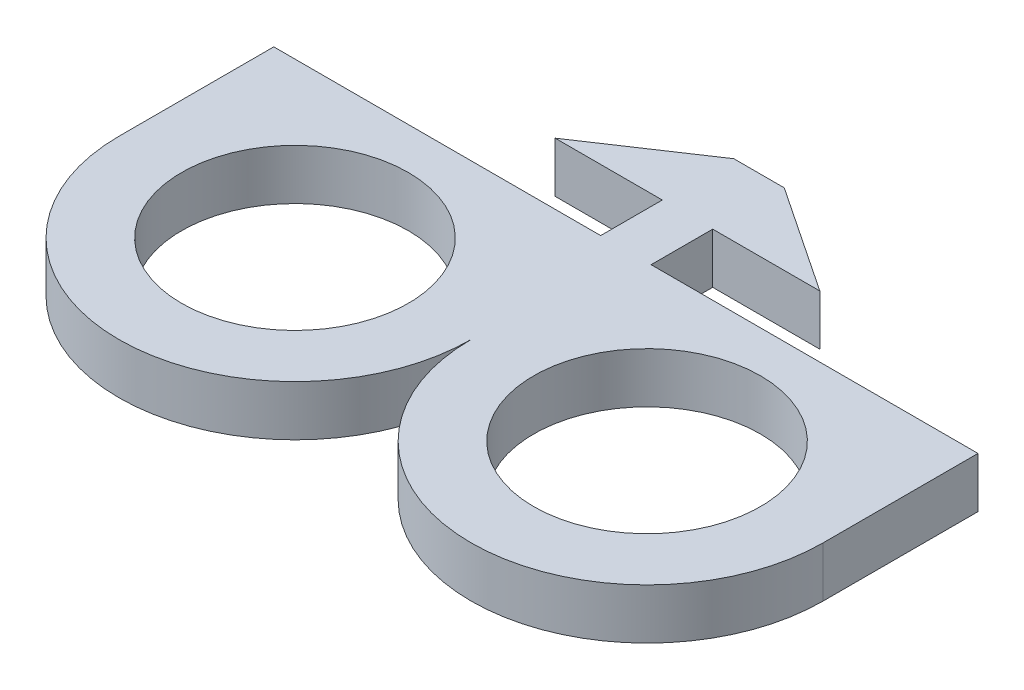
ISO-10303-21;
HEADER;
FILE_DESCRIPTION(('STEP AP214'),'2;1');
FILE_NAME('part.step','',(''),(''),'','','');
FILE_SCHEMA(('AUTOMOTIVE_DESIGN { 1 0 10303 214 1 1 1 1 }'));
ENDSEC;
DATA;
#1=APPLICATION_CONTEXT('core data for automotive mechanical design processes');
#2=APPLICATION_PROTOCOL_DEFINITION('international standard','automotive_design',2000,#1);
#3=PRODUCT_CONTEXT('',#1,'mechanical');
#4=PRODUCT('Part','Part','',(#3));
#5=PRODUCT_RELATED_PRODUCT_CATEGORY('part','',(#4));
#6=PRODUCT_DEFINITION_FORMATION('','',#4);
#7=PRODUCT_DEFINITION_CONTEXT('part definition',#1,'design');
#8=PRODUCT_DEFINITION('design','',#6,#7);
#9=PRODUCT_DEFINITION_SHAPE('','',#8);
#10=(LENGTH_UNIT() NAMED_UNIT(*) SI_UNIT(.MILLI.,.METRE.));
#11=(NAMED_UNIT(*) PLANE_ANGLE_UNIT() SI_UNIT($,.RADIAN.));
#12=(NAMED_UNIT(*) SI_UNIT($,.STERADIAN.) SOLID_ANGLE_UNIT());
#13=UNCERTAINTY_MEASURE_WITH_UNIT(LENGTH_MEASURE(1.E-05),#10,'distance_accuracy_value','');
#14=(GEOMETRIC_REPRESENTATION_CONTEXT(3) GLOBAL_UNCERTAINTY_ASSIGNED_CONTEXT((#13)) GLOBAL_UNIT_ASSIGNED_CONTEXT((#10,
#11,#12)) REPRESENTATION_CONTEXT('',''));
#15=CARTESIAN_POINT('',(0.,0.,0.));
#16=DIRECTION('',(0.,0.,1.));
#17=DIRECTION('',(1.,0.,0.));
#18=AXIS2_PLACEMENT_3D('',#15,#16,#17);
#19=CARTESIAN_POINT('',(25.0063,3.5814,0.));
#20=DIRECTION('',(-1.,0.,0.));
#21=DIRECTION('',(0.,0.,1.));
#22=AXIS2_PLACEMENT_3D('',#19,#20,#21);
#23=PLANE('',#22);
#24=DIRECTION('',(0.,0.,-1.));
#25=VECTOR('',#24,1.);
#26=CARTESIAN_POINT('',(25.0063,0.,0.));
#27=LINE('',#26,#25);
#28=CARTESIAN_POINT('',(25.0063,0.,13.1856988));
#29=VERTEX_POINT('',#28);
#30=CARTESIAN_POINT('',(25.0063,0.,2.1874988));
#31=VERTEX_POINT('',#30);
#32=EDGE_CURVE('E176',#29,#31,#27,.T.);
#33=ORIENTED_EDGE('',*,*,#32,.T.);
#34=DIRECTION('',(0.,-1.,0.));
#35=VECTOR('',#34,1.);
#36=CARTESIAN_POINT('',(25.0063,3.5814,2.1874988));
#37=LINE('',#36,#35);
#38=CARTESIAN_POINT('',(25.0063,3.5814,2.1874988));
#39=VERTEX_POINT('',#38);
#40=EDGE_CURVE('E54',#39,#31,#37,.T.);
#41=ORIENTED_EDGE('',*,*,#40,.F.);
#42=DIRECTION('',(0.,0.,-1.));
#43=VECTOR('',#42,1.);
#44=CARTESIAN_POINT('',(25.0063,3.5814,0.));
#45=LINE('',#44,#43);
#46=CARTESIAN_POINT('',(25.0063,3.5814,13.1856988));
#47=VERTEX_POINT('',#46);
#48=EDGE_CURVE('E119',#47,#39,#45,.T.);
#49=ORIENTED_EDGE('',*,*,#48,.F.);
#50=DIRECTION('',(0.,-1.,0.));
#51=VECTOR('',#50,1.);
#52=CARTESIAN_POINT('',(25.0063,3.5814,13.1856988));
#53=LINE('',#52,#51);
#54=EDGE_CURVE('E12',#47,#29,#53,.T.);
#55=ORIENTED_EDGE('',*,*,#54,.T.);
#56=EDGE_LOOP('',(#33,#41,#49,#55));
#57=FACE_BOUND('',#56,.T.);
#58=ADVANCED_FACE('F47',(#57),#23,.F.);
#59=CARTESIAN_POINT('',(0.,3.5814,2.1874988));
#60=DIRECTION('',(0.,0.,-1.));
#61=DIRECTION('',(-1.,0.,0.));
#62=AXIS2_PLACEMENT_3D('',#59,#60,#61);
#63=PLANE('',#62);
#64=DIRECTION('',(1.,0.,0.));
#65=VECTOR('',#64,1.);
#66=CARTESIAN_POINT('',(0.,0.,2.1874988));
#67=LINE('',#66,#65);
#68=CARTESIAN_POINT('',(1.7907,0.,2.1874988));
#69=VERTEX_POINT('',#68);
#70=EDGE_CURVE('E179',#69,#31,#67,.T.);
#71=ORIENTED_EDGE('',*,*,#70,.F.);
#72=DIRECTION('',(0.,-1.,0.));
#73=VECTOR('',#72,1.);
#74=CARTESIAN_POINT('',(1.7907,3.5814,2.1874988));
#75=LINE('',#74,#73);
#76=CARTESIAN_POINT('',(1.7907,3.5814,2.1874988));
#77=VERTEX_POINT('',#76);
#78=EDGE_CURVE('E219',#77,#69,#75,.T.);
#79=ORIENTED_EDGE('',*,*,#78,.F.);
#80=DIRECTION('',(1.,0.,0.));
#81=VECTOR('',#80,1.);
#82=CARTESIAN_POINT('',(0.,3.5814,2.1874988));
#83=LINE('',#82,#81);
#84=EDGE_CURVE('E224',#77,#39,#83,.T.);
#85=ORIENTED_EDGE('',*,*,#84,.T.);
#86=ORIENTED_EDGE('',*,*,#40,.T.);
#87=EDGE_LOOP('',(#71,#79,#85,#86));
#88=FACE_BOUND('',#87,.T.);
#89=ADVANCED_FACE('F223',(#88),#63,.T.);
#90=CARTESIAN_POINT('',(1.7907,3.5814,0.));
#91=DIRECTION('',(-1.,0.,0.));
#92=DIRECTION('',(0.,0.,1.));
#93=AXIS2_PLACEMENT_3D('',#90,#91,#92);
#94=PLANE('',#93);
#95=DIRECTION('',(0.,0.,-1.));
#96=VECTOR('',#95,1.);
#97=CARTESIAN_POINT('',(1.7907,0.,0.));
#98=LINE('',#97,#96);
#99=CARTESIAN_POINT('',(1.7907,0.,-2.1874988));
#100=VERTEX_POINT('',#99);
#101=EDGE_CURVE('E183',#69,#100,#98,.T.);
#102=ORIENTED_EDGE('',*,*,#101,.T.);
#103=DIRECTION('',(0.,-1.,0.));
#104=VECTOR('',#103,1.);
#105=CARTESIAN_POINT('',(1.7907,3.5814,-2.1874988));
#106=LINE('',#105,#104);
#107=CARTESIAN_POINT('',(1.7907,3.5814,-2.1874988));
#108=VERTEX_POINT('',#107);
#109=EDGE_CURVE('E217',#108,#100,#106,.T.);
#110=ORIENTED_EDGE('',*,*,#109,.F.);
#111=DIRECTION('',(0.,0.,-1.));
#112=VECTOR('',#111,1.);
#113=CARTESIAN_POINT('',(1.7907,3.5814,0.));
#114=LINE('',#113,#112);
#115=EDGE_CURVE('E237',#77,#108,#114,.T.);
#116=ORIENTED_EDGE('',*,*,#115,.F.);
#117=ORIENTED_EDGE('',*,*,#78,.T.);
#118=EDGE_LOOP('',(#102,#110,#116,#117));
#119=FACE_BOUND('',#118,.T.);
#120=ADVANCED_FACE('F234',(#119),#94,.F.);
#121=CARTESIAN_POINT('',(0.,3.5814,-2.1874988));
#122=DIRECTION('',(0.,0.,1.));
#123=DIRECTION('',(1.,0.,0.));
#124=AXIS2_PLACEMENT_3D('',#121,#122,#123);
#125=PLANE('',#124);
#126=DIRECTION('',(-1.,0.,0.));
#127=VECTOR('',#126,1.);
#128=CARTESIAN_POINT('',(0.,0.,-2.1874988));
#129=LINE('',#128,#127);
#130=CARTESIAN_POINT('',(9.398,0.,-2.1874988));
#131=VERTEX_POINT('',#130);
#132=EDGE_CURVE('E186',#131,#100,#129,.T.);
#133=ORIENTED_EDGE('',*,*,#132,.F.);
#134=DIRECTION('',(0.,-1.,0.));
#135=VECTOR('',#134,1.);
#136=CARTESIAN_POINT('',(9.398,3.5814,-2.1874988));
#137=LINE('',#136,#135);
#138=CARTESIAN_POINT('',(9.398,3.5814,-2.1874988));
#139=VERTEX_POINT('',#138);
#140=EDGE_CURVE('E215',#139,#131,#137,.T.);
#141=ORIENTED_EDGE('',*,*,#140,.F.);
#142=DIRECTION('',(-1.,0.,0.));
#143=VECTOR('',#142,1.);
#144=CARTESIAN_POINT('',(0.,3.5814,-2.1874988));
#145=LINE('',#144,#143);
#146=EDGE_CURVE('E239',#139,#108,#145,.T.);
#147=ORIENTED_EDGE('',*,*,#146,.T.);
#148=ORIENTED_EDGE('',*,*,#109,.T.);
#149=EDGE_LOOP('',(#133,#141,#147,#148));
#150=FACE_BOUND('',#149,.T.);
#151=ADVANCED_FACE('F313',(#150),#125,.T.);
#152=CARTESIAN_POINT('',(3.90863686168685,3.5814,-5.85318370037606));
#153=DIRECTION('',(0.55534080959066,0.,-0.831622862362014));
#154=DIRECTION('',(-0.831622862362014,0.,-0.55534080959066));
#155=AXIS2_PLACEMENT_3D('',#152,#153,#154);
#156=PLANE('',#155);
#157=DIRECTION('',(0.831622862362014,0.,0.55534080959066));
#158=VECTOR('',#157,1.);
#159=CARTESIAN_POINT('',(3.90863686168685,0.,-5.85318370037606));
#160=LINE('',#159,#158);
#161=CARTESIAN_POINT('',(1.7907,0.,-7.2674988));
#162=VERTEX_POINT('',#161);
#163=EDGE_CURVE('E189',#162,#131,#160,.T.);
#164=ORIENTED_EDGE('',*,*,#163,.F.);
#165=DIRECTION('',(0.,-1.,0.));
#166=VECTOR('',#165,1.);
#167=CARTESIAN_POINT('',(1.7907,3.5814,-7.2674988));
#168=LINE('',#167,#166);
#169=CARTESIAN_POINT('',(1.7907,3.5814,-7.2674988));
#170=VERTEX_POINT('',#169);
#171=EDGE_CURVE('E213',#170,#162,#168,.T.);
#172=ORIENTED_EDGE('',*,*,#171,.F.);
#173=DIRECTION('',(0.831622862362014,0.,0.55534080959066));
#174=VECTOR('',#173,1.);
#175=CARTESIAN_POINT('',(3.90863686168685,3.5814,-5.85318370037606));
#176=LINE('',#175,#174);
#177=EDGE_CURVE('E246',#170,#139,#176,.T.);
#178=ORIENTED_EDGE('',*,*,#177,.T.);
#179=ORIENTED_EDGE('',*,*,#140,.T.);
#180=EDGE_LOOP('',(#164,#172,#178,#179));
#181=FACE_BOUND('',#180,.T.);
#182=ADVANCED_FACE('F318',(#181),#156,.T.);
#183=CARTESIAN_POINT('',(0.,3.5814,-7.2674988));
#184=DIRECTION('',(0.,0.,-1.));
#185=DIRECTION('',(-1.,0.,0.));
#186=AXIS2_PLACEMENT_3D('',#183,#184,#185);
#187=PLANE('',#186);
#188=DIRECTION('',(1.,0.,0.));
#189=VECTOR('',#188,1.);
#190=CARTESIAN_POINT('',(0.,0.,-7.2674988));
#191=LINE('',#190,#189);
#192=CARTESIAN_POINT('',(-1.7907,0.,-7.2674988));
#193=VERTEX_POINT('',#192);
#194=EDGE_CURVE('E192',#193,#162,#191,.T.);
#195=ORIENTED_EDGE('',*,*,#194,.F.);
#196=DIRECTION('',(0.,-1.,0.));
#197=VECTOR('',#196,1.);
#198=CARTESIAN_POINT('',(-1.7907,3.5814,-7.2674988));
#199=LINE('',#198,#197);
#200=CARTESIAN_POINT('',(-1.7907,3.5814,-7.2674988));
#201=VERTEX_POINT('',#200);
#202=EDGE_CURVE('E211',#201,#193,#199,.T.);
#203=ORIENTED_EDGE('',*,*,#202,.F.);
#204=DIRECTION('',(1.,0.,0.));
#205=VECTOR('',#204,1.);
#206=CARTESIAN_POINT('',(0.,3.5814,-7.2674988));
#207=LINE('',#206,#205);
#208=EDGE_CURVE('E249',#201,#170,#207,.T.);
#209=ORIENTED_EDGE('',*,*,#208,.T.);
#210=ORIENTED_EDGE('',*,*,#171,.T.);
#211=EDGE_LOOP('',(#195,#203,#209,#210));
#212=FACE_BOUND('',#211,.T.);
#213=ADVANCED_FACE('F322',(#212),#187,.T.);
#214=CARTESIAN_POINT('',(-3.90863686168685,3.5814,-5.85318370037606));
#215=DIRECTION('',(-0.55534080959066,0.,-0.831622862362014));
#216=DIRECTION('',(-0.831622862362014,0.,0.55534080959066));
#217=AXIS2_PLACEMENT_3D('',#214,#215,#216);
#218=PLANE('',#217);
#219=DIRECTION('',(0.831622862362014,0.,-0.55534080959066));
#220=VECTOR('',#219,1.);
#221=CARTESIAN_POINT('',(-3.90863686168685,0.,-5.85318370037606));
#222=LINE('',#221,#220);
#223=CARTESIAN_POINT('',(-9.398,0.,-2.1874988));
#224=VERTEX_POINT('',#223);
#225=EDGE_CURVE('E195',#224,#193,#222,.T.);
#226=ORIENTED_EDGE('',*,*,#225,.F.);
#227=DIRECTION('',(0.,-1.,0.));
#228=VECTOR('',#227,1.);
#229=CARTESIAN_POINT('',(-9.398,3.5814,-2.1874988));
#230=LINE('',#229,#228);
#231=CARTESIAN_POINT('',(-9.398,3.5814,-2.1874988));
#232=VERTEX_POINT('',#231);
#233=EDGE_CURVE('E209',#232,#224,#230,.T.);
#234=ORIENTED_EDGE('',*,*,#233,.F.);
#235=DIRECTION('',(0.831622862362014,0.,-0.55534080959066));
#236=VECTOR('',#235,1.);
#237=CARTESIAN_POINT('',(-3.90863686168685,3.5814,-5.85318370037606));
#238=LINE('',#237,#236);
#239=EDGE_CURVE('E170',#232,#201,#238,.T.);
#240=ORIENTED_EDGE('',*,*,#239,.T.);
#241=ORIENTED_EDGE('',*,*,#202,.T.);
#242=EDGE_LOOP('',(#226,#234,#240,#241));
#243=FACE_BOUND('',#242,.T.);
#244=ADVANCED_FACE('F254',(#243),#218,.T.);
#245=CARTESIAN_POINT('',(0.,3.5814,-2.1874988));
#246=DIRECTION('',(0.,0.,1.));
#247=DIRECTION('',(1.,0.,0.));
#248=AXIS2_PLACEMENT_3D('',#245,#246,#247);
#249=PLANE('',#248);
#250=DIRECTION('',(-1.,0.,0.));
#251=VECTOR('',#250,1.);
#252=CARTESIAN_POINT('',(0.,0.,-2.1874988));
#253=LINE('',#252,#251);
#254=CARTESIAN_POINT('',(-1.7907,0.,-2.1874988));
#255=VERTEX_POINT('',#254);
#256=EDGE_CURVE('E198',#255,#224,#253,.T.);
#257=ORIENTED_EDGE('',*,*,#256,.F.);
#258=DIRECTION('',(0.,-1.,0.));
#259=VECTOR('',#258,1.);
#260=CARTESIAN_POINT('',(-1.7907,3.5814,-2.1874988));
#261=LINE('',#260,#259);
#262=CARTESIAN_POINT('',(-1.7907,3.5814,-2.1874988));
#263=VERTEX_POINT('',#262);
#264=EDGE_CURVE('E157',#263,#255,#261,.T.);
#265=ORIENTED_EDGE('',*,*,#264,.F.);
#266=DIRECTION('',(-1.,0.,0.));
#267=VECTOR('',#266,1.);
#268=CARTESIAN_POINT('',(0.,3.5814,-2.1874988));
#269=LINE('',#268,#267);
#270=EDGE_CURVE('E168',#263,#232,#269,.T.);
#271=ORIENTED_EDGE('',*,*,#270,.T.);
#272=ORIENTED_EDGE('',*,*,#233,.T.);
#273=EDGE_LOOP('',(#257,#265,#271,#272));
#274=FACE_BOUND('',#273,.T.);
#275=ADVANCED_FACE('F260',(#274),#249,.T.);
#276=CARTESIAN_POINT('',(-1.7907,3.5814,0.));
#277=DIRECTION('',(-1.,0.,0.));
#278=DIRECTION('',(0.,0.,1.));
#279=AXIS2_PLACEMENT_3D('',#276,#277,#278);
#280=PLANE('',#279);
#281=DIRECTION('',(0.,0.,-1.));
#282=VECTOR('',#281,1.);
#283=CARTESIAN_POINT('',(-1.7907,0.,0.));
#284=LINE('',#283,#282);
#285=CARTESIAN_POINT('',(-1.7907,0.,2.1874988));
#286=VERTEX_POINT('',#285);
#287=EDGE_CURVE('E154',#286,#255,#284,.T.);
#288=ORIENTED_EDGE('',*,*,#287,.F.);
#289=DIRECTION('',(0.,-1.,0.));
#290=VECTOR('',#289,1.);
#291=CARTESIAN_POINT('',(-1.7907,3.5814,2.1874988));
#292=LINE('',#291,#290);
#293=CARTESIAN_POINT('',(-1.7907,3.5814,2.1874988));
#294=VERTEX_POINT('',#293);
#295=EDGE_CURVE('E148',#294,#286,#292,.T.);
#296=ORIENTED_EDGE('',*,*,#295,.F.);
#297=DIRECTION('',(0.,0.,-1.));
#298=VECTOR('',#297,1.);
#299=CARTESIAN_POINT('',(-1.7907,3.5814,0.));
#300=LINE('',#299,#298);
#301=EDGE_CURVE('E152',#294,#263,#300,.T.);
#302=ORIENTED_EDGE('',*,*,#301,.T.);
#303=ORIENTED_EDGE('',*,*,#264,.T.);
#304=EDGE_LOOP('',(#288,#296,#302,#303));
#305=FACE_BOUND('',#304,.T.);
#306=ADVANCED_FACE('F150',(#305),#280,.T.);
#307=CARTESIAN_POINT('',(0.,3.5814,2.1874988));
#308=DIRECTION('',(0.,0.,1.));
#309=DIRECTION('',(1.,0.,0.));
#310=AXIS2_PLACEMENT_3D('',#307,#308,#309);
#311=PLANE('',#310);
#312=DIRECTION('',(-1.,0.,0.));
#313=VECTOR('',#312,1.);
#314=CARTESIAN_POINT('',(0.,0.,2.1874988));
#315=LINE('',#314,#313);
#316=CARTESIAN_POINT('',(-25.0063,0.,2.1874988));
#317=VERTEX_POINT('',#316);
#318=EDGE_CURVE('E202',#286,#317,#315,.T.);
#319=ORIENTED_EDGE('',*,*,#318,.T.);
#320=DIRECTION('',(0.,-1.,0.));
#321=VECTOR('',#320,1.);
#322=CARTESIAN_POINT('',(-25.0063,3.5814,2.1874988));
#323=LINE('',#322,#321);
#324=CARTESIAN_POINT('',(-25.0063,3.5814,2.1874988));
#325=VERTEX_POINT('',#324);
#326=EDGE_CURVE('E158',#325,#317,#323,.T.);
#327=ORIENTED_EDGE('',*,*,#326,.F.);
#328=DIRECTION('',(-1.,0.,0.));
#329=VECTOR('',#328,1.);
#330=CARTESIAN_POINT('',(0.,3.5814,2.1874988));
#331=LINE('',#330,#329);
#332=EDGE_CURVE('E161',#294,#325,#331,.T.);
#333=ORIENTED_EDGE('',*,*,#332,.F.);
#334=ORIENTED_EDGE('',*,*,#295,.T.);
#335=EDGE_LOOP('',(#319,#327,#333,#334));
#336=FACE_BOUND('',#335,.T.);
#337=ADVANCED_FACE('F162',(#336),#311,.F.);
#338=CARTESIAN_POINT('',(-25.0063,3.5814,0.));
#339=DIRECTION('',(1.,0.,0.));
#340=DIRECTION('',(0.,0.,-1.));
#341=AXIS2_PLACEMENT_3D('',#338,#339,#340);
#342=PLANE('',#341);
#343=DIRECTION('',(0.,0.,1.));
#344=VECTOR('',#343,1.);
#345=CARTESIAN_POINT('',(-25.0063,0.,0.));
#346=LINE('',#345,#344);
#347=CARTESIAN_POINT('',(-25.0063,0.,13.1856988));
#348=VERTEX_POINT('',#347);
#349=EDGE_CURVE('E112',#317,#348,#346,.T.);
#350=ORIENTED_EDGE('',*,*,#349,.T.);
#351=DIRECTION('',(0.,-1.,0.));
#352=VECTOR('',#351,1.);
#353=CARTESIAN_POINT('',(-25.0063,3.5814,13.1856988));
#354=LINE('',#353,#352);
#355=CARTESIAN_POINT('',(-25.0063,3.5814,13.1856988));
#356=VERTEX_POINT('',#355);
#357=EDGE_CURVE('E175',#356,#348,#354,.T.);
#358=ORIENTED_EDGE('',*,*,#357,.F.);
#359=DIRECTION('',(0.,0.,1.));
#360=VECTOR('',#359,1.);
#361=CARTESIAN_POINT('',(-25.0063,3.5814,0.));
#362=LINE('',#361,#360);
#363=EDGE_CURVE('E70',#325,#356,#362,.T.);
#364=ORIENTED_EDGE('',*,*,#363,.F.);
#365=ORIENTED_EDGE('',*,*,#326,.T.);
#366=EDGE_LOOP('',(#350,#358,#364,#365));
#367=FACE_BOUND('',#366,.T.);
#368=ADVANCED_FACE('F261',(#367),#342,.F.);
#369=CARTESIAN_POINT('',(0.,3.5814,0.));
#370=DIRECTION('',(0.,1.,0.));
#371=DIRECTION('',(0.,0.,1.));
#372=AXIS2_PLACEMENT_3D('',#369,#370,#371);
#373=PLANE('',#372);
#374=CARTESIAN_POINT('',(-12.50315,3.5814,13.1856988));
#375=DIRECTION('',(0.,1.,0.));
#376=DIRECTION('',(0.,0.,1.));
#377=AXIS2_PLACEMENT_3D('',#374,#375,#376);
#378=CIRCLE('',#377,8.0518);
#379=CARTESIAN_POINT('',(-12.50315,3.5814,21.2374988));
#380=VERTEX_POINT('',#379);
#381=EDGE_CURVE('E279',#380,#380,#378,.T.);
#382=ORIENTED_EDGE('',*,*,#381,.F.);
#383=EDGE_LOOP('',(#382));
#384=FACE_BOUND('',#383,.T.);
#385=CARTESIAN_POINT('',(12.50315,3.5814,13.1856988));
#386=DIRECTION('',(0.,1.,0.));
#387=DIRECTION('',(0.,0.,1.));
#388=AXIS2_PLACEMENT_3D('',#385,#386,#387);
#389=CIRCLE('',#388,8.0518);
#390=CARTESIAN_POINT('',(12.50315,3.5814,21.2374988));
#391=VERTEX_POINT('',#390);
#392=EDGE_CURVE('E289',#391,#391,#389,.T.);
#393=ORIENTED_EDGE('',*,*,#392,.F.);
#394=EDGE_LOOP('',(#393));
#395=FACE_BOUND('',#394,.T.);
#396=ORIENTED_EDGE('',*,*,#363,.T.);
#397=CARTESIAN_POINT('',(-12.50315,3.5814,13.1856988));
#398=DIRECTION('',(0.,1.,0.));
#399=DIRECTION('',(0.,0.,1.));
#400=AXIS2_PLACEMENT_3D('',#397,#398,#399);
#401=CIRCLE('',#400,12.50315);
#402=CARTESIAN_POINT('',(0.,3.5814,13.1856988));
#403=VERTEX_POINT('',#402);
#404=EDGE_CURVE('E265',#356,#403,#401,.T.);
#405=ORIENTED_EDGE('',*,*,#404,.T.);
#406=CARTESIAN_POINT('',(12.50315,3.5814,13.1856988));
#407=DIRECTION('',(0.,1.,0.));
#408=DIRECTION('',(0.,0.,1.));
#409=AXIS2_PLACEMENT_3D('',#406,#407,#408);
#410=CIRCLE('',#409,12.50315);
#411=EDGE_CURVE('E61',#403,#47,#410,.T.);
#412=ORIENTED_EDGE('',*,*,#411,.T.);
#413=ORIENTED_EDGE('',*,*,#48,.T.);
#414=ORIENTED_EDGE('',*,*,#84,.F.);
#415=ORIENTED_EDGE('',*,*,#115,.T.);
#416=ORIENTED_EDGE('',*,*,#146,.F.);
#417=ORIENTED_EDGE('',*,*,#177,.F.);
#418=ORIENTED_EDGE('',*,*,#208,.F.);
#419=ORIENTED_EDGE('',*,*,#239,.F.);
#420=ORIENTED_EDGE('',*,*,#270,.F.);
#421=ORIENTED_EDGE('',*,*,#301,.F.);
#422=ORIENTED_EDGE('',*,*,#332,.T.);
#423=EDGE_LOOP('',(#396,#405,#412,#413,#414,#415,#416,#417,#418,#419,#420,#421,#422));
#424=FACE_BOUND('',#423,.T.);
#425=ADVANCED_FACE('F165',(#384,#395,#424),#373,.T.);
#426=CARTESIAN_POINT('',(0.,0.,0.));
#427=DIRECTION('',(0.,1.,0.));
#428=DIRECTION('',(0.,0.,1.));
#429=AXIS2_PLACEMENT_3D('',#426,#427,#428);
#430=PLANE('',#429);
#431=CARTESIAN_POINT('',(-12.50315,0.,13.1856988));
#432=DIRECTION('',(0.,1.,0.));
#433=DIRECTION('',(0.,0.,1.));
#434=AXIS2_PLACEMENT_3D('',#431,#432,#433);
#435=CIRCLE('',#434,8.0518);
#436=CARTESIAN_POINT('',(-12.50315,0.,21.2374988));
#437=VERTEX_POINT('',#436);
#438=EDGE_CURVE('E277',#437,#437,#435,.T.);
#439=ORIENTED_EDGE('',*,*,#438,.T.);
#440=EDGE_LOOP('',(#439));
#441=FACE_BOUND('',#440,.T.);
#442=CARTESIAN_POINT('',(12.50315,0.,13.1856988));
#443=DIRECTION('',(0.,1.,0.));
#444=DIRECTION('',(0.,0.,1.));
#445=AXIS2_PLACEMENT_3D('',#442,#443,#444);
#446=CIRCLE('',#445,8.0518);
#447=CARTESIAN_POINT('',(12.50315,0.,21.2374988));
#448=VERTEX_POINT('',#447);
#449=EDGE_CURVE('E284',#448,#448,#446,.T.);
#450=ORIENTED_EDGE('',*,*,#449,.T.);
#451=EDGE_LOOP('',(#450));
#452=FACE_BOUND('',#451,.T.);
#453=ORIENTED_EDGE('',*,*,#32,.F.);
#454=CARTESIAN_POINT('',(12.50315,0.,13.1856988));
#455=DIRECTION('',(0.,1.,0.));
#456=DIRECTION('',(0.,0.,1.));
#457=AXIS2_PLACEMENT_3D('',#454,#455,#456);
#458=CIRCLE('',#457,12.50315);
#459=CARTESIAN_POINT('',(0.,0.,13.1856988));
#460=VERTEX_POINT('',#459);
#461=EDGE_CURVE('E268',#29,#460,#458,.F.);
#462=ORIENTED_EDGE('',*,*,#461,.T.);
#463=CARTESIAN_POINT('',(-12.50315,0.,13.1856988));
#464=DIRECTION('',(0.,1.,0.));
#465=DIRECTION('',(0.,0.,1.));
#466=AXIS2_PLACEMENT_3D('',#463,#464,#465);
#467=CIRCLE('',#466,12.50315);
#468=EDGE_CURVE('E180',#460,#348,#467,.F.);
#469=ORIENTED_EDGE('',*,*,#468,.T.);
#470=ORIENTED_EDGE('',*,*,#349,.F.);
#471=ORIENTED_EDGE('',*,*,#318,.F.);
#472=ORIENTED_EDGE('',*,*,#287,.T.);
#473=ORIENTED_EDGE('',*,*,#256,.T.);
#474=ORIENTED_EDGE('',*,*,#225,.T.);
#475=ORIENTED_EDGE('',*,*,#194,.T.);
#476=ORIENTED_EDGE('',*,*,#163,.T.);
#477=ORIENTED_EDGE('',*,*,#132,.T.);
#478=ORIENTED_EDGE('',*,*,#101,.F.);
#479=ORIENTED_EDGE('',*,*,#70,.T.);
#480=EDGE_LOOP('',(#453,#462,#469,#470,#471,#472,#473,#474,#475,#476,#477,#478,#479));
#481=FACE_BOUND('',#480,.T.);
#482=ADVANCED_FACE('F230',(#441,#452,#481),#430,.F.);
#483=CARTESIAN_POINT('',(-12.50315,-27.9578933328765,13.1856988));
#484=DIRECTION('',(0.,1.,0.));
#485=DIRECTION('',(0.,0.,1.));
#486=AXIS2_PLACEMENT_3D('',#483,#484,#485);
#487=CYLINDRICAL_SURFACE('',#486,12.50315);
#488=ORIENTED_EDGE('',*,*,#468,.F.);
#489=DIRECTION('',(0.,1.,0.));
#490=VECTOR('',#489,1.);
#491=CARTESIAN_POINT('',(0.,-27.9578933328765,13.1856988));
#492=LINE('',#491,#490);
#493=EDGE_CURVE('E267',#460,#403,#492,.T.);
#494=ORIENTED_EDGE('',*,*,#493,.T.);
#495=ORIENTED_EDGE('',*,*,#404,.F.);
#496=ORIENTED_EDGE('',*,*,#357,.T.);
#497=EDGE_LOOP('',(#488,#494,#495,#496));
#498=FACE_BOUND('',#497,.T.);
#499=ADVANCED_FACE('F266',(#498),#487,.T.);
#500=CARTESIAN_POINT('',(12.50315,-27.9578933328765,13.1856988));
#501=DIRECTION('',(0.,1.,0.));
#502=DIRECTION('',(0.,0.,1.));
#503=AXIS2_PLACEMENT_3D('',#500,#501,#502);
#504=CYLINDRICAL_SURFACE('',#503,12.50315);
#505=ORIENTED_EDGE('',*,*,#461,.F.);
#506=ORIENTED_EDGE('',*,*,#54,.F.);
#507=ORIENTED_EDGE('',*,*,#411,.F.);
#508=ORIENTED_EDGE('',*,*,#493,.F.);
#509=EDGE_LOOP('',(#505,#506,#507,#508));
#510=FACE_BOUND('',#509,.T.);
#511=ADVANCED_FACE('F276',(#510),#504,.T.);
#512=CARTESIAN_POINT('',(12.50315,0.,13.1856988));
#513=DIRECTION('',(0.,1.,0.));
#514=DIRECTION('',(0.,0.,1.));
#515=AXIS2_PLACEMENT_3D('',#512,#513,#514);
#516=CYLINDRICAL_SURFACE('',#515,8.0518);
#517=ORIENTED_EDGE('',*,*,#449,.F.);
#518=EDGE_LOOP('',(#517));
#519=FACE_BOUND('',#518,.T.);
#520=ORIENTED_EDGE('',*,*,#392,.T.);
#521=EDGE_LOOP('',(#520));
#522=FACE_BOUND('',#521,.T.);
#523=ADVANCED_FACE('F293',(#519,#522),#516,.F.);
#524=CARTESIAN_POINT('',(-12.50315,0.,13.1856988));
#525=DIRECTION('',(0.,1.,0.));
#526=DIRECTION('',(0.,0.,1.));
#527=AXIS2_PLACEMENT_3D('',#524,#525,#526);
#528=CYLINDRICAL_SURFACE('',#527,8.0518);
#529=ORIENTED_EDGE('',*,*,#438,.F.);
#530=EDGE_LOOP('',(#529));
#531=FACE_BOUND('',#530,.T.);
#532=ORIENTED_EDGE('',*,*,#381,.T.);
#533=EDGE_LOOP('',(#532));
#534=FACE_BOUND('',#533,.T.);
#535=ADVANCED_FACE('F381',(#531,#534),#528,.F.);
#536=CLOSED_SHELL('',(#58,#89,#120,#151,#182,#213,#244,#275,#306,#337,#368,#425,#482,#499,#511,
#523,#535));
#537=MANIFOLD_SOLID_BREP('B2',#536);
#538=ADVANCED_BREP_SHAPE_REPRESENTATION('',(#18,#537),#14);
#539=SHAPE_DEFINITION_REPRESENTATION(#9,#538);
ENDSEC;
END-ISO-10303-21;
